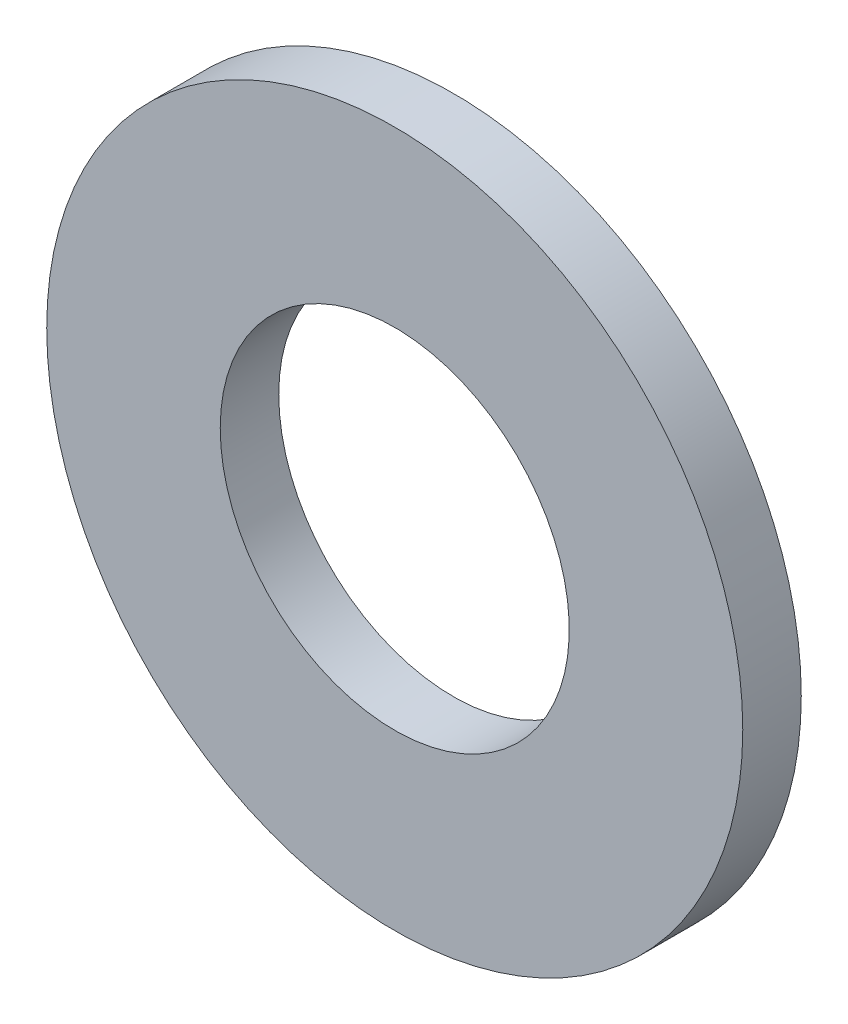
ISO-10303-21;
HEADER;
FILE_DESCRIPTION(('STEP AP214'),'2;1');
FILE_NAME('part.step','',(''),(''),'','','');
FILE_SCHEMA(('AUTOMOTIVE_DESIGN { 1 0 10303 214 1 1 1 1 }'));
ENDSEC;
DATA;
#1=APPLICATION_CONTEXT('core data for automotive mechanical design processes');
#2=APPLICATION_PROTOCOL_DEFINITION('international standard','automotive_design',2000,#1);
#3=PRODUCT_CONTEXT('',#1,'mechanical');
#4=PRODUCT('Part','Part','',(#3));
#5=PRODUCT_RELATED_PRODUCT_CATEGORY('part','',(#4));
#6=PRODUCT_DEFINITION_FORMATION('','',#4);
#7=PRODUCT_DEFINITION_CONTEXT('part definition',#1,'design');
#8=PRODUCT_DEFINITION('design','',#6,#7);
#9=PRODUCT_DEFINITION_SHAPE('','',#8);
#10=(LENGTH_UNIT() NAMED_UNIT(*) SI_UNIT(.MILLI.,.METRE.));
#11=(NAMED_UNIT(*) PLANE_ANGLE_UNIT() SI_UNIT($,.RADIAN.));
#12=(NAMED_UNIT(*) SI_UNIT($,.STERADIAN.) SOLID_ANGLE_UNIT());
#13=UNCERTAINTY_MEASURE_WITH_UNIT(LENGTH_MEASURE(1.E-05),#10,'distance_accuracy_value','');
#14=(GEOMETRIC_REPRESENTATION_CONTEXT(3) GLOBAL_UNCERTAINTY_ASSIGNED_CONTEXT((#13)) GLOBAL_UNIT_ASSIGNED_CONTEXT((#10,
#11,#12)) REPRESENTATION_CONTEXT('',''));
#15=CARTESIAN_POINT('',(0.,0.,0.));
#16=DIRECTION('',(0.,0.,1.));
#17=DIRECTION('',(1.,0.,0.));
#18=AXIS2_PLACEMENT_3D('',#15,#16,#17);
#19=CARTESIAN_POINT('',(0.,0.,1.4732));
#20=DIRECTION('',(0.,0.,-1.));
#21=DIRECTION('',(-1.,0.,0.));
#22=AXIS2_PLACEMENT_3D('',#19,#20,#21);
#23=CYLINDRICAL_SURFACE('',#22,4.3942);
#24=CARTESIAN_POINT('',(0.,0.,1.4732));
#25=DIRECTION('',(0.,0.,-1.));
#26=DIRECTION('',(-1.,0.,0.));
#27=AXIS2_PLACEMENT_3D('',#24,#25,#26);
#28=CIRCLE('',#27,4.3942);
#29=CARTESIAN_POINT('',(-4.3942,0.,1.4732));
#30=VERTEX_POINT('',#29);
#31=EDGE_CURVE('E27',#30,#30,#28,.F.);
#32=ORIENTED_EDGE('',*,*,#31,.T.);
#33=EDGE_LOOP('',(#32));
#34=FACE_BOUND('',#33,.T.);
#35=CARTESIAN_POINT('',(0.,0.,0.));
#36=DIRECTION('',(0.,0.,-1.));
#37=DIRECTION('',(-1.,0.,0.));
#38=AXIS2_PLACEMENT_3D('',#35,#36,#37);
#39=CIRCLE('',#38,4.3942);
#40=CARTESIAN_POINT('',(-4.3942,0.,0.));
#41=VERTEX_POINT('',#40);
#42=EDGE_CURVE('E18',#41,#41,#39,.T.);
#43=ORIENTED_EDGE('',*,*,#42,.T.);
#44=EDGE_LOOP('',(#43));
#45=FACE_BOUND('',#44,.T.);
#46=ADVANCED_FACE('F15',(#34,#45),#23,.F.);
#47=CARTESIAN_POINT('',(0.,0.,0.));
#48=DIRECTION('',(0.,0.,-1.));
#49=DIRECTION('',(-1.,0.,0.));
#50=AXIS2_PLACEMENT_3D('',#47,#48,#49);
#51=PLANE('',#50);
#52=ORIENTED_EDGE('',*,*,#42,.F.);
#53=EDGE_LOOP('',(#52));
#54=FACE_BOUND('',#53,.T.);
#55=CARTESIAN_POINT('',(0.,0.,-8.2254407278437E-10));
#56=DIRECTION('',(0.,0.,-1.));
#57=DIRECTION('',(-1.,0.,0.));
#58=AXIS2_PLACEMENT_3D('',#55,#56,#57);
#59=CIRCLE('',#58,8.763);
#60=CARTESIAN_POINT('',(-8.763,0.,-8.2254407278437E-10));
#61=VERTEX_POINT('',#60);
#62=EDGE_CURVE('E22',#61,#61,#59,.T.);
#63=ORIENTED_EDGE('',*,*,#62,.T.);
#64=EDGE_LOOP('',(#63));
#65=FACE_BOUND('',#64,.T.);
#66=ADVANCED_FACE('F36',(#54,#65),#51,.T.);
#67=CARTESIAN_POINT('',(0.,0.,1.47320000005161));
#68=DIRECTION('',(0.,0.,-1.));
#69=DIRECTION('',(-1.,0.,0.));
#70=AXIS2_PLACEMENT_3D('',#67,#68,#69);
#71=PLANE('',#70);
#72=ORIENTED_EDGE('',*,*,#31,.F.);
#73=EDGE_LOOP('',(#72));
#74=FACE_BOUND('',#73,.T.);
#75=CARTESIAN_POINT('',(0.,0.,1.4732));
#76=DIRECTION('',(0.,0.,-1.));
#77=DIRECTION('',(-1.,0.,0.));
#78=AXIS2_PLACEMENT_3D('',#75,#76,#77);
#79=CIRCLE('',#78,8.763);
#80=CARTESIAN_POINT('',(-8.763,0.,1.4732));
#81=VERTEX_POINT('',#80);
#82=EDGE_CURVE('E10',#81,#81,#79,.F.);
#83=ORIENTED_EDGE('',*,*,#82,.T.);
#84=EDGE_LOOP('',(#83));
#85=FACE_BOUND('',#84,.T.);
#86=ADVANCED_FACE('F39',(#74,#85),#71,.F.);
#87=CARTESIAN_POINT('',(0.,0.,1.4732));
#88=DIRECTION('',(0.,0.,-1.));
#89=DIRECTION('',(-1.,0.,0.));
#90=AXIS2_PLACEMENT_3D('',#87,#88,#89);
#91=CYLINDRICAL_SURFACE('',#90,8.763);
#92=ORIENTED_EDGE('',*,*,#82,.F.);
#93=EDGE_LOOP('',(#92));
#94=FACE_BOUND('',#93,.T.);
#95=ORIENTED_EDGE('',*,*,#62,.F.);
#96=EDGE_LOOP('',(#95));
#97=FACE_BOUND('',#96,.T.);
#98=ADVANCED_FACE('F42',(#94,#97),#91,.T.);
#99=CLOSED_SHELL('',(#46,#66,#86,#98));
#100=MANIFOLD_SOLID_BREP('B1',#99);
#101=ADVANCED_BREP_SHAPE_REPRESENTATION('',(#18,#100),#14);
#102=SHAPE_DEFINITION_REPRESENTATION(#9,#101);
ENDSEC;
END-ISO-10303-21;
